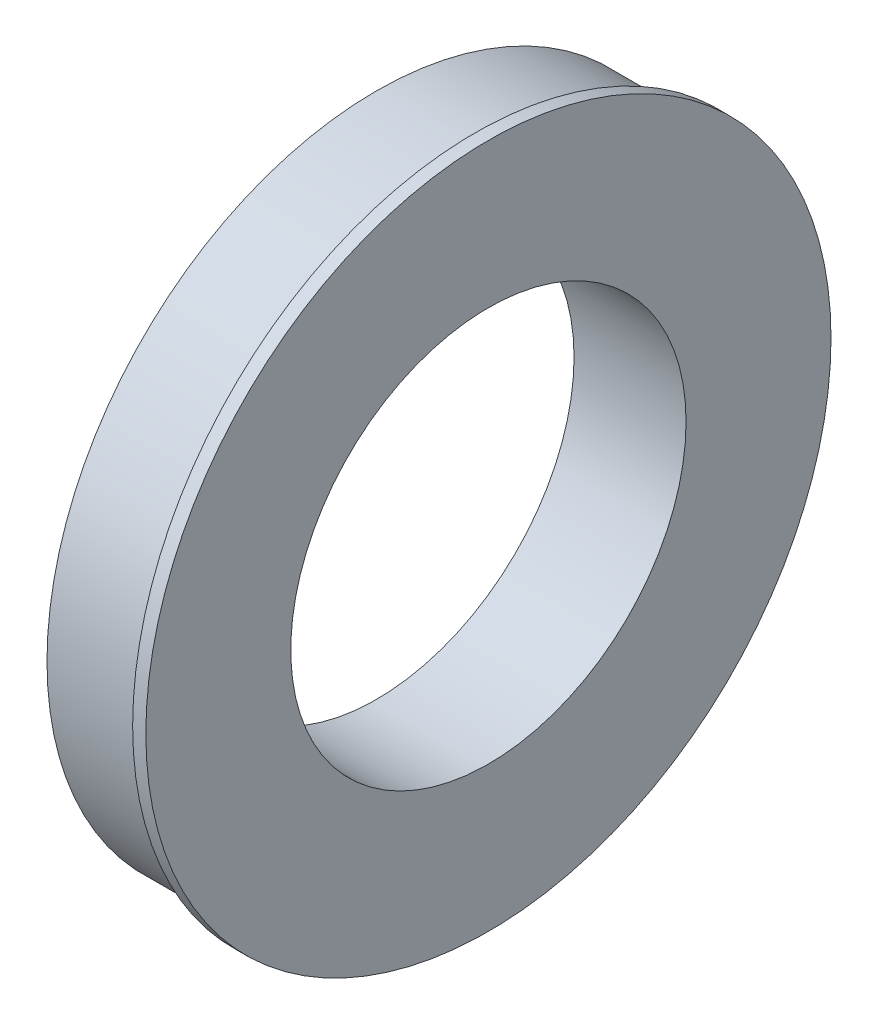
ISO-10303-21;
HEADER;
FILE_DESCRIPTION(('STEP AP214'),'2;1');
FILE_NAME('part.step','',(''),(''),'','','');
FILE_SCHEMA(('AUTOMOTIVE_DESIGN { 1 0 10303 214 1 1 1 1 }'));
ENDSEC;
DATA;
#1=APPLICATION_CONTEXT('core data for automotive mechanical design processes');
#2=APPLICATION_PROTOCOL_DEFINITION('international standard','automotive_design',2000,#1);
#3=PRODUCT_CONTEXT('',#1,'mechanical');
#4=PRODUCT('Part','Part','',(#3));
#5=PRODUCT_RELATED_PRODUCT_CATEGORY('part','',(#4));
#6=PRODUCT_DEFINITION_FORMATION('','',#4);
#7=PRODUCT_DEFINITION_CONTEXT('part definition',#1,'design');
#8=PRODUCT_DEFINITION('design','',#6,#7);
#9=PRODUCT_DEFINITION_SHAPE('','',#8);
#10=(LENGTH_UNIT() NAMED_UNIT(*) SI_UNIT(.MILLI.,.METRE.));
#11=(NAMED_UNIT(*) PLANE_ANGLE_UNIT() SI_UNIT($,.RADIAN.));
#12=(NAMED_UNIT(*) SI_UNIT($,.STERADIAN.) SOLID_ANGLE_UNIT());
#13=UNCERTAINTY_MEASURE_WITH_UNIT(LENGTH_MEASURE(1.E-05),#10,'distance_accuracy_value','');
#14=(GEOMETRIC_REPRESENTATION_CONTEXT(3) GLOBAL_UNCERTAINTY_ASSIGNED_CONTEXT((#13)) GLOBAL_UNIT_ASSIGNED_CONTEXT((#10,
#11,#12)) REPRESENTATION_CONTEXT('',''));
#15=CARTESIAN_POINT('',(0.,0.,0.));
#16=DIRECTION('',(0.,0.,1.));
#17=DIRECTION('',(1.,0.,0.));
#18=AXIS2_PLACEMENT_3D('',#15,#16,#17);
#19=CARTESIAN_POINT('',(-9.525,0.,0.));
#20=DIRECTION('',(1.,0.,0.));
#21=DIRECTION('',(0.,0.,-1.));
#22=AXIS2_PLACEMENT_3D('',#19,#20,#21);
#23=PLANE('',#22);
#24=CARTESIAN_POINT('',(-9.525,0.,0.));
#25=DIRECTION('',(1.,0.,0.));
#26=DIRECTION('',(0.,0.,-1.));
#27=AXIS2_PLACEMENT_3D('',#24,#25,#26);
#28=CIRCLE('',#27,63.5);
#29=CARTESIAN_POINT('',(-9.525,0.,-63.5));
#30=VERTEX_POINT('',#29);
#31=EDGE_CURVE('E39',#30,#30,#28,.T.);
#32=ORIENTED_EDGE('',*,*,#31,.F.);
#33=EDGE_LOOP('',(#32));
#34=FACE_BOUND('',#33,.T.);
#35=CARTESIAN_POINT('',(-9.525,0.,0.));
#36=DIRECTION('',(1.,0.,0.));
#37=DIRECTION('',(0.,0.,-1.));
#38=AXIS2_PLACEMENT_3D('',#35,#36,#37);
#39=CIRCLE('',#38,38.1);
#40=CARTESIAN_POINT('',(-9.525,0.,-38.1));
#41=VERTEX_POINT('',#40);
#42=EDGE_CURVE('E46',#41,#41,#39,.T.);
#43=ORIENTED_EDGE('',*,*,#42,.T.);
#44=EDGE_LOOP('',(#43));
#45=FACE_BOUND('',#44,.T.);
#46=ADVANCED_FACE('F35',(#34,#45),#23,.F.);
#47=CARTESIAN_POINT('',(9.525,0.,0.));
#48=DIRECTION('',(-1.,0.,0.));
#49=DIRECTION('',(0.,0.,1.));
#50=AXIS2_PLACEMENT_3D('',#47,#48,#49);
#51=CYLINDRICAL_SURFACE('',#50,63.5);
#52=CARTESIAN_POINT('',(9.525,0.,0.));
#53=DIRECTION('',(1.,0.,0.));
#54=DIRECTION('',(0.,0.,-1.));
#55=AXIS2_PLACEMENT_3D('',#52,#53,#54);
#56=CIRCLE('',#55,63.5);
#57=CARTESIAN_POINT('',(9.525,0.,-63.5));
#58=VERTEX_POINT('',#57);
#59=EDGE_CURVE('E10',#58,#58,#56,.T.);
#60=ORIENTED_EDGE('',*,*,#59,.F.);
#61=EDGE_LOOP('',(#60));
#62=FACE_BOUND('',#61,.T.);
#63=ORIENTED_EDGE('',*,*,#31,.T.);
#64=EDGE_LOOP('',(#63));
#65=FACE_BOUND('',#64,.T.);
#66=ADVANCED_FACE('F37',(#62,#65),#51,.T.);
#67=CARTESIAN_POINT('',(9.525,0.,0.));
#68=DIRECTION('',(-1.,0.,0.));
#69=DIRECTION('',(0.,0.,1.));
#70=AXIS2_PLACEMENT_3D('',#67,#68,#69);
#71=CYLINDRICAL_SURFACE('',#70,38.1);
#72=ORIENTED_EDGE('',*,*,#42,.F.);
#73=EDGE_LOOP('',(#72));
#74=FACE_BOUND('',#73,.T.);
#75=CARTESIAN_POINT('',(12.065,0.,0.));
#76=DIRECTION('',(1.,0.,0.));
#77=DIRECTION('',(0.,0.,-1.));
#78=AXIS2_PLACEMENT_3D('',#75,#76,#77);
#79=CIRCLE('',#78,38.1);
#80=CARTESIAN_POINT('',(12.065,0.,-38.1));
#81=VERTEX_POINT('',#80);
#82=EDGE_CURVE('E54',#81,#81,#79,.T.);
#83=ORIENTED_EDGE('',*,*,#82,.T.);
#84=EDGE_LOOP('',(#83));
#85=FACE_BOUND('',#84,.T.);
#86=ADVANCED_FACE('F60',(#74,#85),#71,.F.);
#87=CARTESIAN_POINT('',(12.065,0.,0.));
#88=DIRECTION('',(1.,0.,0.));
#89=DIRECTION('',(0.,0.,-1.));
#90=AXIS2_PLACEMENT_3D('',#87,#88,#89);
#91=PLANE('',#90);
#92=CARTESIAN_POINT('',(12.065,0.,0.));
#93=DIRECTION('',(1.,0.,0.));
#94=DIRECTION('',(0.,0.,-1.));
#95=AXIS2_PLACEMENT_3D('',#92,#93,#94);
#96=CIRCLE('',#95,66.04);
#97=CARTESIAN_POINT('',(12.065,0.,-66.04));
#98=VERTEX_POINT('',#97);
#99=EDGE_CURVE('E50',#98,#98,#96,.T.);
#100=ORIENTED_EDGE('',*,*,#99,.T.);
#101=EDGE_LOOP('',(#100));
#102=FACE_BOUND('',#101,.T.);
#103=ORIENTED_EDGE('',*,*,#82,.F.);
#104=EDGE_LOOP('',(#103));
#105=FACE_BOUND('',#104,.T.);
#106=ADVANCED_FACE('F62',(#102,#105),#91,.T.);
#107=CARTESIAN_POINT('',(9.525,0.,0.));
#108=DIRECTION('',(1.,0.,0.));
#109=DIRECTION('',(0.,0.,-1.));
#110=AXIS2_PLACEMENT_3D('',#107,#108,#109);
#111=PLANE('',#110);
#112=ORIENTED_EDGE('',*,*,#59,.T.);
#113=EDGE_LOOP('',(#112));
#114=FACE_BOUND('',#113,.T.);
#115=CARTESIAN_POINT('',(9.525,0.,0.));
#116=DIRECTION('',(1.,0.,0.));
#117=DIRECTION('',(0.,0.,-1.));
#118=AXIS2_PLACEMENT_3D('',#115,#116,#117);
#119=CIRCLE('',#118,66.04);
#120=CARTESIAN_POINT('',(9.525,0.,-66.04));
#121=VERTEX_POINT('',#120);
#122=EDGE_CURVE('E51',#121,#121,#119,.T.);
#123=ORIENTED_EDGE('',*,*,#122,.F.);
#124=EDGE_LOOP('',(#123));
#125=FACE_BOUND('',#124,.T.);
#126=ADVANCED_FACE('F64',(#114,#125),#111,.F.);
#127=CARTESIAN_POINT('',(12.065,0.,0.));
#128=DIRECTION('',(-1.,0.,0.));
#129=DIRECTION('',(0.,0.,1.));
#130=AXIS2_PLACEMENT_3D('',#127,#128,#129);
#131=CYLINDRICAL_SURFACE('',#130,66.04);
#132=ORIENTED_EDGE('',*,*,#99,.F.);
#133=EDGE_LOOP('',(#132));
#134=FACE_BOUND('',#133,.T.);
#135=ORIENTED_EDGE('',*,*,#122,.T.);
#136=EDGE_LOOP('',(#135));
#137=FACE_BOUND('',#136,.T.);
#138=ADVANCED_FACE('F71',(#134,#137),#131,.T.);
#139=CLOSED_SHELL('',(#46,#66,#86,#106,#126,#138));
#140=MANIFOLD_SOLID_BREP('B2',#139);
#141=ADVANCED_BREP_SHAPE_REPRESENTATION('',(#18,#140),#14);
#142=SHAPE_DEFINITION_REPRESENTATION(#9,#141);
ENDSEC;
END-ISO-10303-21;
